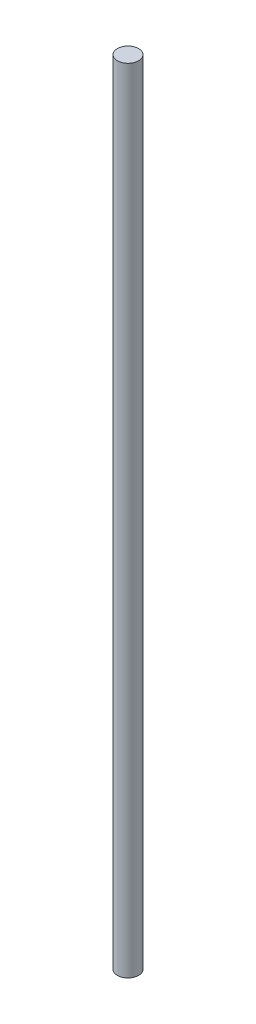
ISO-10303-21;
HEADER;
FILE_DESCRIPTION(('STEP AP214'),'2;1');
FILE_NAME('part.step','',(''),(''),'','','');
FILE_SCHEMA(('AUTOMOTIVE_DESIGN { 1 0 10303 214 1 1 1 1 }'));
ENDSEC;
DATA;
#1=APPLICATION_CONTEXT('core data for automotive mechanical design processes');
#2=APPLICATION_PROTOCOL_DEFINITION('international standard','automotive_design',2000,#1);
#3=PRODUCT_CONTEXT('',#1,'mechanical');
#4=PRODUCT('Part','Part','',(#3));
#5=PRODUCT_RELATED_PRODUCT_CATEGORY('part','',(#4));
#6=PRODUCT_DEFINITION_FORMATION('','',#4);
#7=PRODUCT_DEFINITION_CONTEXT('part definition',#1,'design');
#8=PRODUCT_DEFINITION('design','',#6,#7);
#9=PRODUCT_DEFINITION_SHAPE('','',#8);
#10=(LENGTH_UNIT() NAMED_UNIT(*) SI_UNIT(.MILLI.,.METRE.));
#11=(NAMED_UNIT(*) PLANE_ANGLE_UNIT() SI_UNIT($,.RADIAN.));
#12=(NAMED_UNIT(*) SI_UNIT($,.STERADIAN.) SOLID_ANGLE_UNIT());
#13=UNCERTAINTY_MEASURE_WITH_UNIT(LENGTH_MEASURE(1.E-05),#10,'distance_accuracy_value','');
#14=(GEOMETRIC_REPRESENTATION_CONTEXT(3) GLOBAL_UNCERTAINTY_ASSIGNED_CONTEXT((#13)) GLOBAL_UNIT_ASSIGNED_CONTEXT((#10,
#11,#12)) REPRESENTATION_CONTEXT('',''));
#15=CARTESIAN_POINT('',(0.,0.,0.));
#16=DIRECTION('',(0.,0.,1.));
#17=DIRECTION('',(1.,0.,0.));
#18=AXIS2_PLACEMENT_3D('',#15,#16,#17);
#19=CARTESIAN_POINT('',(0.,177.8,0.));
#20=DIRECTION('',(0.,-1.,0.));
#21=DIRECTION('',(0.,0.,-1.));
#22=AXIS2_PLACEMENT_3D('',#19,#20,#21);
#23=CYLINDRICAL_SURFACE('',#22,2.38125);
#24=CARTESIAN_POINT('',(0.,177.8,0.));
#25=DIRECTION('',(0.,1.,0.));
#26=DIRECTION('',(0.,0.,1.));
#27=AXIS2_PLACEMENT_3D('',#24,#25,#26);
#28=CIRCLE('',#27,2.38125);
#29=CARTESIAN_POINT('',(0.,177.8,2.38125));
#30=VERTEX_POINT('',#29);
#31=EDGE_CURVE('E10',#30,#30,#28,.T.);
#32=ORIENTED_EDGE('',*,*,#31,.F.);
#33=EDGE_LOOP('',(#32));
#34=FACE_BOUND('',#33,.T.);
#35=CARTESIAN_POINT('',(0.,0.,0.));
#36=DIRECTION('',(0.,1.,0.));
#37=DIRECTION('',(0.,0.,1.));
#38=AXIS2_PLACEMENT_3D('',#35,#36,#37);
#39=CIRCLE('',#38,2.38125);
#40=CARTESIAN_POINT('',(0.,0.,2.38125));
#41=VERTEX_POINT('',#40);
#42=EDGE_CURVE('E34',#41,#41,#39,.T.);
#43=ORIENTED_EDGE('',*,*,#42,.T.);
#44=EDGE_LOOP('',(#43));
#45=FACE_BOUND('',#44,.T.);
#46=ADVANCED_FACE('F31',(#34,#45),#23,.T.);
#47=CARTESIAN_POINT('',(0.,177.8,0.));
#48=DIRECTION('',(0.,1.,0.));
#49=DIRECTION('',(0.,0.,1.));
#50=AXIS2_PLACEMENT_3D('',#47,#48,#49);
#51=PLANE('',#50);
#52=ORIENTED_EDGE('',*,*,#31,.T.);
#53=EDGE_LOOP('',(#52));
#54=FACE_BOUND('',#53,.T.);
#55=ADVANCED_FACE('F46',(#54),#51,.T.);
#56=CARTESIAN_POINT('',(0.,0.,0.));
#57=DIRECTION('',(0.,1.,0.));
#58=DIRECTION('',(0.,0.,1.));
#59=AXIS2_PLACEMENT_3D('',#56,#57,#58);
#60=PLANE('',#59);
#61=ORIENTED_EDGE('',*,*,#42,.F.);
#62=EDGE_LOOP('',(#61));
#63=FACE_BOUND('',#62,.T.);
#64=ADVANCED_FACE('F44',(#63),#60,.F.);
#65=CLOSED_SHELL('',(#46,#55,#64));
#66=MANIFOLD_SOLID_BREP('B2',#65);
#67=ADVANCED_BREP_SHAPE_REPRESENTATION('',(#18,#66),#14);
#68=SHAPE_DEFINITION_REPRESENTATION(#9,#67);
ENDSEC;
END-ISO-10303-21;
